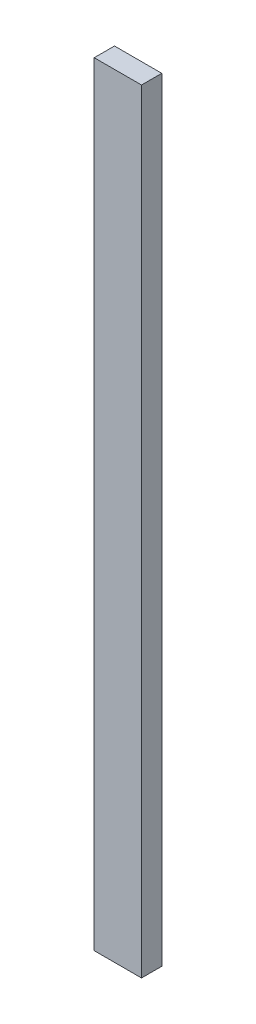
ISO-10303-21;
HEADER;
FILE_DESCRIPTION(('STEP AP214'),'2;1');
FILE_NAME('part.step','',(''),(''),'','','');
FILE_SCHEMA(('AUTOMOTIVE_DESIGN { 1 0 10303 214 1 1 1 1 }'));
ENDSEC;
DATA;
#1=APPLICATION_CONTEXT('core data for automotive mechanical design processes');
#2=APPLICATION_PROTOCOL_DEFINITION('international standard','automotive_design',2000,#1);
#3=PRODUCT_CONTEXT('',#1,'mechanical');
#4=PRODUCT('Part','Part','',(#3));
#5=PRODUCT_RELATED_PRODUCT_CATEGORY('part','',(#4));
#6=PRODUCT_DEFINITION_FORMATION('','',#4);
#7=PRODUCT_DEFINITION_CONTEXT('part definition',#1,'design');
#8=PRODUCT_DEFINITION('design','',#6,#7);
#9=PRODUCT_DEFINITION_SHAPE('','',#8);
#10=(LENGTH_UNIT() NAMED_UNIT(*) SI_UNIT(.MILLI.,.METRE.));
#11=(NAMED_UNIT(*) PLANE_ANGLE_UNIT() SI_UNIT($,.RADIAN.));
#12=(NAMED_UNIT(*) SI_UNIT($,.STERADIAN.) SOLID_ANGLE_UNIT());
#13=UNCERTAINTY_MEASURE_WITH_UNIT(LENGTH_MEASURE(1.E-05),#10,'distance_accuracy_value','');
#14=(GEOMETRIC_REPRESENTATION_CONTEXT(3) GLOBAL_UNCERTAINTY_ASSIGNED_CONTEXT((#13)) GLOBAL_UNIT_ASSIGNED_CONTEXT((#10,
#11,#12)) REPRESENTATION_CONTEXT('',''));
#15=CARTESIAN_POINT('',(0.,0.,0.));
#16=DIRECTION('',(0.,0.,1.));
#17=DIRECTION('',(1.,0.,0.));
#18=AXIS2_PLACEMENT_3D('',#15,#16,#17);
#19=CARTESIAN_POINT('',(-44.45,1454.15,19.05));
#20=DIRECTION('',(-1.,0.,0.));
#21=DIRECTION('',(0.,0.,1.));
#22=AXIS2_PLACEMENT_3D('',#19,#20,#21);
#23=PLANE('',#22);
#24=DIRECTION('',(0.,0.,-1.));
#25=VECTOR('',#24,1.);
#26=CARTESIAN_POINT('',(-44.45,0.,19.05));
#27=LINE('',#26,#25);
#28=CARTESIAN_POINT('',(-44.45,0.,19.05));
#29=VERTEX_POINT('',#28);
#30=CARTESIAN_POINT('',(-44.45,0.,-19.05));
#31=VERTEX_POINT('',#30);
#32=EDGE_CURVE('E104',#29,#31,#27,.T.);
#33=ORIENTED_EDGE('',*,*,#32,.F.);
#34=DIRECTION('',(0.,-1.,0.));
#35=VECTOR('',#34,1.);
#36=CARTESIAN_POINT('',(-44.45,1454.15,19.05));
#37=LINE('',#36,#35);
#38=CARTESIAN_POINT('',(-44.45,1454.15,19.05));
#39=VERTEX_POINT('',#38);
#40=EDGE_CURVE('E11',#39,#29,#37,.T.);
#41=ORIENTED_EDGE('',*,*,#40,.F.);
#42=DIRECTION('',(0.,0.,-1.));
#43=VECTOR('',#42,1.);
#44=CARTESIAN_POINT('',(-44.45,1454.15,19.05));
#45=LINE('',#44,#43);
#46=CARTESIAN_POINT('',(-44.45,1454.15,-19.05));
#47=VERTEX_POINT('',#46);
#48=EDGE_CURVE('E99',#39,#47,#45,.T.);
#49=ORIENTED_EDGE('',*,*,#48,.T.);
#50=DIRECTION('',(0.,-1.,0.));
#51=VECTOR('',#50,1.);
#52=CARTESIAN_POINT('',(-44.45,1454.15,-19.05));
#53=LINE('',#52,#51);
#54=EDGE_CURVE('E42',#47,#31,#53,.T.);
#55=ORIENTED_EDGE('',*,*,#54,.T.);
#56=EDGE_LOOP('',(#33,#41,#49,#55));
#57=FACE_BOUND('',#56,.T.);
#58=ADVANCED_FACE('F39',(#57),#23,.T.);
#59=CARTESIAN_POINT('',(-44.45,1454.15,19.05));
#60=DIRECTION('',(0.,0.,-1.));
#61=DIRECTION('',(-1.,0.,0.));
#62=AXIS2_PLACEMENT_3D('',#59,#60,#61);
#63=PLANE('',#62);
#64=DIRECTION('',(1.,0.,0.));
#65=VECTOR('',#64,1.);
#66=CARTESIAN_POINT('',(-44.45,0.,19.05));
#67=LINE('',#66,#65);
#68=CARTESIAN_POINT('',(44.45,0.,19.05));
#69=VERTEX_POINT('',#68);
#70=EDGE_CURVE('E72',#29,#69,#67,.T.);
#71=ORIENTED_EDGE('',*,*,#70,.T.);
#72=DIRECTION('',(0.,-1.,0.));
#73=VECTOR('',#72,1.);
#74=CARTESIAN_POINT('',(44.45,1454.15,19.05));
#75=LINE('',#74,#73);
#76=CARTESIAN_POINT('',(44.45,1454.15,19.05));
#77=VERTEX_POINT('',#76);
#78=EDGE_CURVE('E48',#77,#69,#75,.T.);
#79=ORIENTED_EDGE('',*,*,#78,.F.);
#80=DIRECTION('',(1.,0.,0.));
#81=VECTOR('',#80,1.);
#82=CARTESIAN_POINT('',(-44.45,1454.15,19.05));
#83=LINE('',#82,#81);
#84=EDGE_CURVE('E89',#39,#77,#83,.T.);
#85=ORIENTED_EDGE('',*,*,#84,.F.);
#86=ORIENTED_EDGE('',*,*,#40,.T.);
#87=EDGE_LOOP('',(#71,#79,#85,#86));
#88=FACE_BOUND('',#87,.T.);
#89=ADVANCED_FACE('F114',(#88),#63,.F.);
#90=CARTESIAN_POINT('',(44.45,1454.15,19.05));
#91=DIRECTION('',(-1.,0.,0.));
#92=DIRECTION('',(0.,0.,1.));
#93=AXIS2_PLACEMENT_3D('',#90,#91,#92);
#94=PLANE('',#93);
#95=DIRECTION('',(0.,0.,-1.));
#96=VECTOR('',#95,1.);
#97=CARTESIAN_POINT('',(44.45,0.,19.05));
#98=LINE('',#97,#96);
#99=CARTESIAN_POINT('',(44.45,0.,-19.05));
#100=VERTEX_POINT('',#99);
#101=EDGE_CURVE('E96',#69,#100,#98,.T.);
#102=ORIENTED_EDGE('',*,*,#101,.T.);
#103=DIRECTION('',(0.,-1.,0.));
#104=VECTOR('',#103,1.);
#105=CARTESIAN_POINT('',(44.45,1454.15,-19.05));
#106=LINE('',#105,#104);
#107=CARTESIAN_POINT('',(44.45,1454.15,-19.05));
#108=VERTEX_POINT('',#107);
#109=EDGE_CURVE('E93',#108,#100,#106,.T.);
#110=ORIENTED_EDGE('',*,*,#109,.F.);
#111=DIRECTION('',(0.,0.,-1.));
#112=VECTOR('',#111,1.);
#113=CARTESIAN_POINT('',(44.45,1454.15,19.05));
#114=LINE('',#113,#112);
#115=EDGE_CURVE('E84',#77,#108,#114,.T.);
#116=ORIENTED_EDGE('',*,*,#115,.F.);
#117=ORIENTED_EDGE('',*,*,#78,.T.);
#118=EDGE_LOOP('',(#102,#110,#116,#117));
#119=FACE_BOUND('',#118,.T.);
#120=ADVANCED_FACE('F94',(#119),#94,.F.);
#121=CARTESIAN_POINT('',(-44.45,1454.15,-19.05));
#122=DIRECTION('',(0.,0.,-1.));
#123=DIRECTION('',(-1.,0.,0.));
#124=AXIS2_PLACEMENT_3D('',#121,#122,#123);
#125=PLANE('',#124);
#126=DIRECTION('',(1.,0.,0.));
#127=VECTOR('',#126,1.);
#128=CARTESIAN_POINT('',(-44.45,0.,-19.05));
#129=LINE('',#128,#127);
#130=EDGE_CURVE('E107',#31,#100,#129,.T.);
#131=ORIENTED_EDGE('',*,*,#130,.F.);
#132=ORIENTED_EDGE('',*,*,#54,.F.);
#133=DIRECTION('',(1.,0.,0.));
#134=VECTOR('',#133,1.);
#135=CARTESIAN_POINT('',(-44.45,1454.15,-19.05));
#136=LINE('',#135,#134);
#137=EDGE_CURVE('E88',#47,#108,#136,.T.);
#138=ORIENTED_EDGE('',*,*,#137,.T.);
#139=ORIENTED_EDGE('',*,*,#109,.T.);
#140=EDGE_LOOP('',(#131,#132,#138,#139));
#141=FACE_BOUND('',#140,.T.);
#142=ADVANCED_FACE('F98',(#141),#125,.T.);
#143=CARTESIAN_POINT('',(0.,1454.15,0.));
#144=DIRECTION('',(0.,-1.,0.));
#145=DIRECTION('',(0.,0.,-1.));
#146=AXIS2_PLACEMENT_3D('',#143,#144,#145);
#147=PLANE('',#146);
#148=ORIENTED_EDGE('',*,*,#48,.F.);
#149=ORIENTED_EDGE('',*,*,#84,.T.);
#150=ORIENTED_EDGE('',*,*,#115,.T.);
#151=ORIENTED_EDGE('',*,*,#137,.F.);
#152=EDGE_LOOP('',(#148,#149,#150,#151));
#153=FACE_BOUND('',#152,.T.);
#154=ADVANCED_FACE('F87',(#153),#147,.F.);
#155=CARTESIAN_POINT('',(0.,0.,0.));
#156=DIRECTION('',(0.,-1.,0.));
#157=DIRECTION('',(0.,0.,-1.));
#158=AXIS2_PLACEMENT_3D('',#155,#156,#157);
#159=PLANE('',#158);
#160=ORIENTED_EDGE('',*,*,#32,.T.);
#161=ORIENTED_EDGE('',*,*,#130,.T.);
#162=ORIENTED_EDGE('',*,*,#101,.F.);
#163=ORIENTED_EDGE('',*,*,#70,.F.);
#164=EDGE_LOOP('',(#160,#161,#162,#163));
#165=FACE_BOUND('',#164,.T.);
#166=ADVANCED_FACE('F112',(#165),#159,.T.);
#167=CLOSED_SHELL('',(#58,#89,#120,#142,#154,#166));
#168=MANIFOLD_SOLID_BREP('B2',#167);
#169=ADVANCED_BREP_SHAPE_REPRESENTATION('',(#18,#168),#14);
#170=SHAPE_DEFINITION_REPRESENTATION(#9,#169);
ENDSEC;
END-ISO-10303-21;
